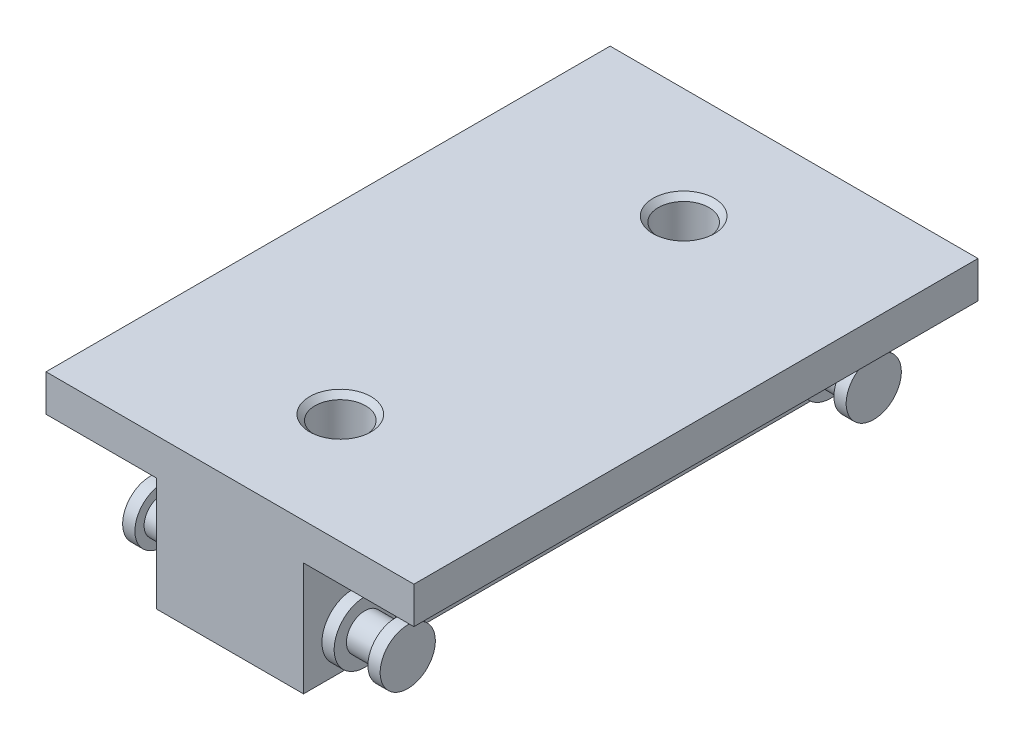
ISO-10303-21;
HEADER;
FILE_DESCRIPTION(('STEP AP214'),'2;1');
FILE_NAME('part.step','',(''),(''),'','','');
FILE_SCHEMA(('AUTOMOTIVE_DESIGN { 1 0 10303 214 1 1 1 1 }'));
ENDSEC;
DATA;
#1=APPLICATION_CONTEXT('core data for automotive mechanical design processes');
#2=APPLICATION_PROTOCOL_DEFINITION('international standard','automotive_design',2000,#1);
#3=PRODUCT_CONTEXT('',#1,'mechanical');
#4=PRODUCT('Part','Part','',(#3));
#5=PRODUCT_RELATED_PRODUCT_CATEGORY('part','',(#4));
#6=PRODUCT_DEFINITION_FORMATION('','',#4);
#7=PRODUCT_DEFINITION_CONTEXT('part definition',#1,'design');
#8=PRODUCT_DEFINITION('design','',#6,#7);
#9=PRODUCT_DEFINITION_SHAPE('','',#8);
#10=(LENGTH_UNIT() NAMED_UNIT(*) SI_UNIT(.MILLI.,.METRE.));
#11=(NAMED_UNIT(*) PLANE_ANGLE_UNIT() SI_UNIT($,.RADIAN.));
#12=(NAMED_UNIT(*) SI_UNIT($,.STERADIAN.) SOLID_ANGLE_UNIT());
#13=UNCERTAINTY_MEASURE_WITH_UNIT(LENGTH_MEASURE(1.E-05),#10,'distance_accuracy_value','');
#14=(GEOMETRIC_REPRESENTATION_CONTEXT(3) GLOBAL_UNCERTAINTY_ASSIGNED_CONTEXT((#13)) GLOBAL_UNIT_ASSIGNED_CONTEXT((#10,
#11,#12)) REPRESENTATION_CONTEXT('',''));
#15=CARTESIAN_POINT('',(0.,0.,0.));
#16=DIRECTION('',(0.,0.,1.));
#17=DIRECTION('',(1.,0.,0.));
#18=AXIS2_PLACEMENT_3D('',#15,#16,#17);
#19=CARTESIAN_POINT('',(-15.,6.25,23.));
#20=DIRECTION('',(-1.,0.,0.));
#21=DIRECTION('',(0.,0.,1.));
#22=AXIS2_PLACEMENT_3D('',#19,#20,#21);
#23=PLANE('',#22);
#24=DIRECTION('',(0.,0.,-1.));
#25=VECTOR('',#24,1.);
#26=CARTESIAN_POINT('',(-15.,3.25,23.));
#27=LINE('',#26,#25);
#28=CARTESIAN_POINT('',(-15.,3.25,23.));
#29=VERTEX_POINT('',#28);
#30=CARTESIAN_POINT('',(-15.,3.25,-23.));
#31=VERTEX_POINT('',#30);
#32=EDGE_CURVE('E161',#29,#31,#27,.T.);
#33=ORIENTED_EDGE('',*,*,#32,.F.);
#34=DIRECTION('',(0.,-1.,0.));
#35=VECTOR('',#34,1.);
#36=CARTESIAN_POINT('',(-15.,6.25,23.));
#37=LINE('',#36,#35);
#38=CARTESIAN_POINT('',(-15.,6.25,23.));
#39=VERTEX_POINT('',#38);
#40=EDGE_CURVE('E11',#39,#29,#37,.T.);
#41=ORIENTED_EDGE('',*,*,#40,.F.);
#42=DIRECTION('',(0.,0.,-1.));
#43=VECTOR('',#42,1.);
#44=CARTESIAN_POINT('',(-15.,6.25,23.));
#45=LINE('',#44,#43);
#46=CARTESIAN_POINT('',(-15.,6.25,-23.));
#47=VERTEX_POINT('',#46);
#48=EDGE_CURVE('E170',#39,#47,#45,.T.);
#49=ORIENTED_EDGE('',*,*,#48,.T.);
#50=DIRECTION('',(0.,-1.,0.));
#51=VECTOR('',#50,1.);
#52=CARTESIAN_POINT('',(-15.,6.25,-23.));
#53=LINE('',#52,#51);
#54=EDGE_CURVE('E46',#47,#31,#53,.T.);
#55=ORIENTED_EDGE('',*,*,#54,.T.);
#56=EDGE_LOOP('',(#33,#41,#49,#55));
#57=FACE_BOUND('',#56,.T.);
#58=ADVANCED_FACE('F43',(#57),#23,.T.);
#59=CARTESIAN_POINT('',(15.,6.25,23.));
#60=DIRECTION('',(0.,0.,1.));
#61=DIRECTION('',(1.,0.,0.));
#62=AXIS2_PLACEMENT_3D('',#59,#60,#61);
#63=PLANE('',#62);
#64=DIRECTION('',(0.,1.,0.));
#65=VECTOR('',#64,1.);
#66=CARTESIAN_POINT('',(6.,-6.,23.));
#67=LINE('',#66,#65);
#68=CARTESIAN_POINT('',(6.,-6.,23.));
#69=VERTEX_POINT('',#68);
#70=CARTESIAN_POINT('',(6.,3.25,23.));
#71=VERTEX_POINT('',#70);
#72=EDGE_CURVE('E60',#69,#71,#67,.T.);
#73=ORIENTED_EDGE('',*,*,#72,.T.);
#74=DIRECTION('',(1.,0.,0.));
#75=VECTOR('',#74,1.);
#76=CARTESIAN_POINT('',(6.,3.25,23.));
#77=LINE('',#76,#75);
#78=CARTESIAN_POINT('',(15.,3.25,23.));
#79=VERTEX_POINT('',#78);
#80=EDGE_CURVE('E118',#71,#79,#77,.T.);
#81=ORIENTED_EDGE('',*,*,#80,.T.);
#82=DIRECTION('',(0.,-1.,0.));
#83=VECTOR('',#82,1.);
#84=CARTESIAN_POINT('',(15.,6.25,23.));
#85=LINE('',#84,#83);
#86=CARTESIAN_POINT('',(15.,6.25,23.));
#87=VERTEX_POINT('',#86);
#88=EDGE_CURVE('E52',#87,#79,#85,.T.);
#89=ORIENTED_EDGE('',*,*,#88,.F.);
#90=DIRECTION('',(-1.,0.,0.));
#91=VECTOR('',#90,1.);
#92=CARTESIAN_POINT('',(15.,6.25,23.));
#93=LINE('',#92,#91);
#94=EDGE_CURVE('E182',#87,#39,#93,.T.);
#95=ORIENTED_EDGE('',*,*,#94,.T.);
#96=ORIENTED_EDGE('',*,*,#40,.T.);
#97=DIRECTION('',(1.,0.,0.));
#98=VECTOR('',#97,1.);
#99=CARTESIAN_POINT('',(-15.,3.25,23.));
#100=LINE('',#99,#98);
#101=CARTESIAN_POINT('',(-6.,3.25,23.));
#102=VERTEX_POINT('',#101);
#103=EDGE_CURVE('E148',#29,#102,#100,.T.);
#104=ORIENTED_EDGE('',*,*,#103,.T.);
#105=DIRECTION('',(0.,-1.,0.));
#106=VECTOR('',#105,1.);
#107=CARTESIAN_POINT('',(-6.,3.25,23.));
#108=LINE('',#107,#106);
#109=CARTESIAN_POINT('',(-6.,-6.,23.));
#110=VERTEX_POINT('',#109);
#111=EDGE_CURVE('E152',#102,#110,#108,.T.);
#112=ORIENTED_EDGE('',*,*,#111,.T.);
#113=DIRECTION('',(-1.,0.,0.));
#114=VECTOR('',#113,1.);
#115=CARTESIAN_POINT('',(15.,-6.,23.));
#116=LINE('',#115,#114);
#117=EDGE_CURVE('E130',#69,#110,#116,.T.);
#118=ORIENTED_EDGE('',*,*,#117,.F.);
#119=EDGE_LOOP('',(#73,#81,#89,#95,#96,#104,#112,#118));
#120=FACE_BOUND('',#119,.T.);
#121=ADVANCED_FACE('F128',(#120),#63,.T.);
#122=CARTESIAN_POINT('',(15.,6.25,-23.));
#123=DIRECTION('',(1.,0.,0.));
#124=DIRECTION('',(0.,0.,-1.));
#125=AXIS2_PLACEMENT_3D('',#122,#123,#124);
#126=PLANE('',#125);
#127=DIRECTION('',(0.,0.,-1.));
#128=VECTOR('',#127,1.);
#129=CARTESIAN_POINT('',(15.,3.25,23.));
#130=LINE('',#129,#128);
#131=CARTESIAN_POINT('',(15.,3.25,-23.));
#132=VERTEX_POINT('',#131);
#133=EDGE_CURVE('E117',#79,#132,#130,.T.);
#134=ORIENTED_EDGE('',*,*,#133,.T.);
#135=DIRECTION('',(0.,-1.,0.));
#136=VECTOR('',#135,1.);
#137=CARTESIAN_POINT('',(15.,6.25,-23.));
#138=LINE('',#137,#136);
#139=CARTESIAN_POINT('',(15.,6.25,-23.));
#140=VERTEX_POINT('',#139);
#141=EDGE_CURVE('E192',#140,#132,#138,.T.);
#142=ORIENTED_EDGE('',*,*,#141,.F.);
#143=DIRECTION('',(0.,0.,1.));
#144=VECTOR('',#143,1.);
#145=CARTESIAN_POINT('',(15.,6.25,-23.));
#146=LINE('',#145,#144);
#147=EDGE_CURVE('E178',#140,#87,#146,.T.);
#148=ORIENTED_EDGE('',*,*,#147,.T.);
#149=ORIENTED_EDGE('',*,*,#88,.T.);
#150=EDGE_LOOP('',(#134,#142,#148,#149));
#151=FACE_BOUND('',#150,.T.);
#152=ADVANCED_FACE('F209',(#151),#126,.T.);
#153=CARTESIAN_POINT('',(-15.,6.25,-23.));
#154=DIRECTION('',(0.,0.,-1.));
#155=DIRECTION('',(-1.,0.,0.));
#156=AXIS2_PLACEMENT_3D('',#153,#154,#155);
#157=PLANE('',#156);
#158=DIRECTION('',(0.,1.,0.));
#159=VECTOR('',#158,1.);
#160=CARTESIAN_POINT('',(6.,-6.,-23.));
#161=LINE('',#160,#159);
#162=CARTESIAN_POINT('',(6.,-6.,-23.));
#163=VERTEX_POINT('',#162);
#164=CARTESIAN_POINT('',(6.,3.25,-23.));
#165=VERTEX_POINT('',#164);
#166=EDGE_CURVE('E113',#163,#165,#161,.T.);
#167=ORIENTED_EDGE('',*,*,#166,.F.);
#168=DIRECTION('',(1.,0.,0.));
#169=VECTOR('',#168,1.);
#170=CARTESIAN_POINT('',(-15.,-6.,-23.));
#171=LINE('',#170,#169);
#172=CARTESIAN_POINT('',(-6.,-6.,-23.));
#173=VERTEX_POINT('',#172);
#174=EDGE_CURVE('E164',#173,#163,#171,.T.);
#175=ORIENTED_EDGE('',*,*,#174,.F.);
#176=DIRECTION('',(0.,-1.,0.));
#177=VECTOR('',#176,1.);
#178=CARTESIAN_POINT('',(-6.,3.25,-23.));
#179=LINE('',#178,#177);
#180=CARTESIAN_POINT('',(-6.,3.25,-23.));
#181=VERTEX_POINT('',#180);
#182=EDGE_CURVE('E68',#181,#173,#179,.T.);
#183=ORIENTED_EDGE('',*,*,#182,.F.);
#184=DIRECTION('',(1.,0.,0.));
#185=VECTOR('',#184,1.);
#186=CARTESIAN_POINT('',(-15.,3.25,-23.));
#187=LINE('',#186,#185);
#188=EDGE_CURVE('E145',#31,#181,#187,.T.);
#189=ORIENTED_EDGE('',*,*,#188,.F.);
#190=ORIENTED_EDGE('',*,*,#54,.F.);
#191=DIRECTION('',(1.,0.,0.));
#192=VECTOR('',#191,1.);
#193=CARTESIAN_POINT('',(-15.,6.25,-23.));
#194=LINE('',#193,#192);
#195=EDGE_CURVE('E174',#47,#140,#194,.T.);
#196=ORIENTED_EDGE('',*,*,#195,.T.);
#197=ORIENTED_EDGE('',*,*,#141,.T.);
#198=DIRECTION('',(1.,0.,0.));
#199=VECTOR('',#198,1.);
#200=CARTESIAN_POINT('',(6.,3.25,-23.));
#201=LINE('',#200,#199);
#202=EDGE_CURVE('E132',#165,#132,#201,.T.);
#203=ORIENTED_EDGE('',*,*,#202,.F.);
#204=EDGE_LOOP('',(#167,#175,#183,#189,#190,#196,#197,#203));
#205=FACE_BOUND('',#204,.T.);
#206=ADVANCED_FACE('F203',(#205),#157,.T.);
#207=CARTESIAN_POINT('',(0.,6.25,0.));
#208=DIRECTION('',(0.,-1.,0.));
#209=DIRECTION('',(0.,0.,-1.));
#210=AXIS2_PLACEMENT_3D('',#207,#208,#209);
#211=PLANE('',#210);
#212=CARTESIAN_POINT('',(0.,6.25,-14.));
#213=DIRECTION('',(0.,-1.,0.));
#214=DIRECTION('',(0.,0.,-1.));
#215=AXIS2_PLACEMENT_3D('',#212,#213,#214);
#216=CIRCLE('',#215,2.5);
#217=CARTESIAN_POINT('',(0.,6.25,-16.5));
#218=VERTEX_POINT('',#217);
#219=EDGE_CURVE('E819',#218,#218,#216,.T.);
#220=ORIENTED_EDGE('',*,*,#219,.T.);
#221=EDGE_LOOP('',(#220));
#222=FACE_BOUND('',#221,.T.);
#223=CARTESIAN_POINT('',(0.,6.25,14.));
#224=DIRECTION('',(0.,-1.,0.));
#225=DIRECTION('',(0.,0.,-1.));
#226=AXIS2_PLACEMENT_3D('',#223,#224,#225);
#227=CIRCLE('',#226,2.5);
#228=CARTESIAN_POINT('',(0.,6.25,11.5));
#229=VERTEX_POINT('',#228);
#230=EDGE_CURVE('E803',#229,#229,#227,.T.);
#231=ORIENTED_EDGE('',*,*,#230,.T.);
#232=EDGE_LOOP('',(#231));
#233=FACE_BOUND('',#232,.T.);
#234=ORIENTED_EDGE('',*,*,#48,.F.);
#235=ORIENTED_EDGE('',*,*,#94,.F.);
#236=ORIENTED_EDGE('',*,*,#147,.F.);
#237=ORIENTED_EDGE('',*,*,#195,.F.);
#238=EDGE_LOOP('',(#234,#235,#236,#237));
#239=FACE_BOUND('',#238,.T.);
#240=ADVANCED_FACE('F206',(#222,#233,#239),#211,.F.);
#241=CARTESIAN_POINT('',(0.,-6.,0.));
#242=DIRECTION('',(0.,-1.,0.));
#243=DIRECTION('',(0.,0.,-1.));
#244=AXIS2_PLACEMENT_3D('',#241,#242,#243);
#245=PLANE('',#244);
#246=CARTESIAN_POINT('',(0.,-6.,-14.));
#247=DIRECTION('',(0.,-1.,0.));
#248=DIRECTION('',(0.,0.,-1.));
#249=AXIS2_PLACEMENT_3D('',#246,#247,#248);
#250=CIRCLE('',#249,2.5);
#251=CARTESIAN_POINT('',(0.,-6.,-16.5));
#252=VERTEX_POINT('',#251);
#253=EDGE_CURVE('E815',#252,#252,#250,.T.);
#254=ORIENTED_EDGE('',*,*,#253,.F.);
#255=EDGE_LOOP('',(#254));
#256=FACE_BOUND('',#255,.T.);
#257=CARTESIAN_POINT('',(0.,-6.,14.));
#258=DIRECTION('',(0.,-1.,0.));
#259=DIRECTION('',(0.,0.,-1.));
#260=AXIS2_PLACEMENT_3D('',#257,#258,#259);
#261=CIRCLE('',#260,2.5);
#262=CARTESIAN_POINT('',(0.,-6.,11.5));
#263=VERTEX_POINT('',#262);
#264=EDGE_CURVE('E799',#263,#263,#261,.T.);
#265=ORIENTED_EDGE('',*,*,#264,.F.);
#266=EDGE_LOOP('',(#265));
#267=FACE_BOUND('',#266,.T.);
#268=DIRECTION('',(0.,0.,-1.));
#269=VECTOR('',#268,1.);
#270=CARTESIAN_POINT('',(6.,-6.,23.));
#271=LINE('',#270,#269);
#272=EDGE_CURVE('E142',#69,#163,#271,.T.);
#273=ORIENTED_EDGE('',*,*,#272,.F.);
#274=ORIENTED_EDGE('',*,*,#117,.T.);
#275=DIRECTION('',(0.,0.,-1.));
#276=VECTOR('',#275,1.);
#277=CARTESIAN_POINT('',(-6.,-6.,23.));
#278=LINE('',#277,#276);
#279=EDGE_CURVE('E165',#110,#173,#278,.T.);
#280=ORIENTED_EDGE('',*,*,#279,.T.);
#281=ORIENTED_EDGE('',*,*,#174,.T.);
#282=EDGE_LOOP('',(#273,#274,#280,#281));
#283=FACE_BOUND('',#282,.T.);
#284=ADVANCED_FACE('F216',(#256,#267,#283),#245,.T.);
#285=CARTESIAN_POINT('',(-15.,3.25,23.));
#286=DIRECTION('',(0.,1.,0.));
#287=DIRECTION('',(0.,0.,1.));
#288=AXIS2_PLACEMENT_3D('',#285,#286,#287);
#289=PLANE('',#288);
#290=ORIENTED_EDGE('',*,*,#188,.T.);
#291=DIRECTION('',(0.,0.,-1.));
#292=VECTOR('',#291,1.);
#293=CARTESIAN_POINT('',(-6.,3.25,23.));
#294=LINE('',#293,#292);
#295=EDGE_CURVE('E155',#102,#181,#294,.T.);
#296=ORIENTED_EDGE('',*,*,#295,.F.);
#297=ORIENTED_EDGE('',*,*,#103,.F.);
#298=ORIENTED_EDGE('',*,*,#32,.T.);
#299=EDGE_LOOP('',(#290,#296,#297,#298));
#300=FACE_BOUND('',#299,.T.);
#301=ADVANCED_FACE('F212',(#300),#289,.F.);
#302=CARTESIAN_POINT('',(-6.,3.25,23.));
#303=DIRECTION('',(1.,0.,0.));
#304=DIRECTION('',(0.,0.,-1.));
#305=AXIS2_PLACEMENT_3D('',#302,#303,#304);
#306=PLANE('',#305);
#307=CARTESIAN_POINT('',(-6.,-3.125,-19.));
#308=DIRECTION('',(1.,0.,0.));
#309=DIRECTION('',(0.,1.,0.));
#310=AXIS2_PLACEMENT_3D('',#307,#308,#309);
#311=CIRCLE('',#310,2.5);
#312=CARTESIAN_POINT('',(-6.,-0.625,-19.));
#313=VERTEX_POINT('',#312);
#314=EDGE_CURVE('E684',#313,#313,#311,.T.);
#315=ORIENTED_EDGE('',*,*,#314,.T.);
#316=EDGE_LOOP('',(#315));
#317=FACE_BOUND('',#316,.T.);
#318=CARTESIAN_POINT('',(-6.,-3.125,19.));
#319=DIRECTION('',(1.,0.,0.));
#320=DIRECTION('',(0.,1.,0.));
#321=AXIS2_PLACEMENT_3D('',#318,#319,#320);
#322=CIRCLE('',#321,2.5);
#323=CARTESIAN_POINT('',(-6.,-0.625,19.));
#324=VERTEX_POINT('',#323);
#325=EDGE_CURVE('E687',#324,#324,#322,.T.);
#326=ORIENTED_EDGE('',*,*,#325,.T.);
#327=EDGE_LOOP('',(#326));
#328=FACE_BOUND('',#327,.T.);
#329=ORIENTED_EDGE('',*,*,#182,.T.);
#330=ORIENTED_EDGE('',*,*,#279,.F.);
#331=ORIENTED_EDGE('',*,*,#111,.F.);
#332=ORIENTED_EDGE('',*,*,#295,.T.);
#333=EDGE_LOOP('',(#329,#330,#331,#332));
#334=FACE_BOUND('',#333,.T.);
#335=ADVANCED_FACE('F213',(#317,#328,#334),#306,.F.);
#336=CARTESIAN_POINT('',(6.,-6.,23.));
#337=DIRECTION('',(-1.,0.,0.));
#338=DIRECTION('',(0.,0.,1.));
#339=AXIS2_PLACEMENT_3D('',#336,#337,#338);
#340=PLANE('',#339);
#341=CARTESIAN_POINT('',(6.,-3.125,-19.));
#342=DIRECTION('',(1.,0.,0.));
#343=DIRECTION('',(0.,0.,-1.));
#344=AXIS2_PLACEMENT_3D('',#341,#342,#343);
#345=CIRCLE('',#344,2.5);
#346=CARTESIAN_POINT('',(6.,-3.125,-21.5));
#347=VERTEX_POINT('',#346);
#348=EDGE_CURVE('E745',#347,#347,#345,.T.);
#349=ORIENTED_EDGE('',*,*,#348,.F.);
#350=EDGE_LOOP('',(#349));
#351=FACE_BOUND('',#350,.T.);
#352=CARTESIAN_POINT('',(6.,-3.125,19.));
#353=DIRECTION('',(1.,0.,0.));
#354=DIRECTION('',(0.,0.,-1.));
#355=AXIS2_PLACEMENT_3D('',#352,#353,#354);
#356=CIRCLE('',#355,2.5);
#357=CARTESIAN_POINT('',(6.,-3.125,16.5));
#358=VERTEX_POINT('',#357);
#359=EDGE_CURVE('E137',#358,#358,#356,.T.);
#360=ORIENTED_EDGE('',*,*,#359,.F.);
#361=EDGE_LOOP('',(#360));
#362=FACE_BOUND('',#361,.T.);
#363=ORIENTED_EDGE('',*,*,#166,.T.);
#364=DIRECTION('',(0.,0.,-1.));
#365=VECTOR('',#364,1.);
#366=CARTESIAN_POINT('',(6.,3.25,23.));
#367=LINE('',#366,#365);
#368=EDGE_CURVE('E109',#71,#165,#367,.T.);
#369=ORIENTED_EDGE('',*,*,#368,.F.);
#370=ORIENTED_EDGE('',*,*,#72,.F.);
#371=ORIENTED_EDGE('',*,*,#272,.T.);
#372=EDGE_LOOP('',(#363,#369,#370,#371));
#373=FACE_BOUND('',#372,.T.);
#374=ADVANCED_FACE('F111',(#351,#362,#373),#340,.F.);
#375=CARTESIAN_POINT('',(6.,3.25,23.));
#376=DIRECTION('',(0.,1.,0.));
#377=DIRECTION('',(0.,0.,1.));
#378=AXIS2_PLACEMENT_3D('',#375,#376,#377);
#379=PLANE('',#378);
#380=ORIENTED_EDGE('',*,*,#202,.T.);
#381=ORIENTED_EDGE('',*,*,#133,.F.);
#382=ORIENTED_EDGE('',*,*,#80,.F.);
#383=ORIENTED_EDGE('',*,*,#368,.T.);
#384=EDGE_LOOP('',(#380,#381,#382,#383));
#385=FACE_BOUND('',#384,.T.);
#386=ADVANCED_FACE('F121',(#385),#379,.F.);
#387=CARTESIAN_POINT('',(6.,-3.125,19.));
#388=DIRECTION('',(1.,0.,0.));
#389=DIRECTION('',(0.,0.,-1.));
#390=AXIS2_PLACEMENT_3D('',#387,#388,#389);
#391=CYLINDRICAL_SURFACE('',#390,2.5);
#392=ORIENTED_EDGE('',*,*,#359,.T.);
#393=EDGE_LOOP('',(#392));
#394=FACE_BOUND('',#393,.T.);
#395=CARTESIAN_POINT('',(7.,-3.125,19.));
#396=DIRECTION('',(1.,0.,0.));
#397=DIRECTION('',(0.,0.,-1.));
#398=AXIS2_PLACEMENT_3D('',#395,#396,#397);
#399=CIRCLE('',#398,2.5);
#400=CARTESIAN_POINT('',(7.,-3.125,16.5));
#401=VERTEX_POINT('',#400);
#402=EDGE_CURVE('E696',#401,#401,#399,.T.);
#403=ORIENTED_EDGE('',*,*,#402,.F.);
#404=EDGE_LOOP('',(#403));
#405=FACE_BOUND('',#404,.T.);
#406=ADVANCED_FACE('F558',(#394,#405),#391,.T.);
#407=CARTESIAN_POINT('',(10.5,-3.125,19.));
#408=DIRECTION('',(1.,0.,0.));
#409=DIRECTION('',(0.,0.,-1.));
#410=AXIS2_PLACEMENT_3D('',#407,#408,#409);
#411=PLANE('',#410);
#412=CARTESIAN_POINT('',(10.5,-3.125,19.));
#413=DIRECTION('',(1.,0.,0.));
#414=DIRECTION('',(0.,0.,-1.));
#415=AXIS2_PLACEMENT_3D('',#412,#413,#414);
#416=CIRCLE('',#415,2.25);
#417=CARTESIAN_POINT('',(10.5,-3.125,16.75));
#418=VERTEX_POINT('',#417);
#419=EDGE_CURVE('E717',#418,#418,#416,.T.);
#420=ORIENTED_EDGE('',*,*,#419,.T.);
#421=EDGE_LOOP('',(#420));
#422=FACE_BOUND('',#421,.T.);
#423=ADVANCED_FACE('F548',(#422),#411,.T.);
#424=CARTESIAN_POINT('',(6.,-3.125,19.));
#425=DIRECTION('',(1.,0.,0.));
#426=DIRECTION('',(0.,0.,-1.));
#427=AXIS2_PLACEMENT_3D('',#424,#425,#426);
#428=CYLINDRICAL_SURFACE('',#427,2.25);
#429=CARTESIAN_POINT('',(9.5,-3.125,19.));
#430=DIRECTION('',(1.,0.,0.));
#431=DIRECTION('',(0.,0.,-1.));
#432=AXIS2_PLACEMENT_3D('',#429,#430,#431);
#433=CIRCLE('',#432,2.25);
#434=CARTESIAN_POINT('',(9.5,-3.125,16.75));
#435=VERTEX_POINT('',#434);
#436=EDGE_CURVE('E714',#435,#435,#433,.T.);
#437=ORIENTED_EDGE('',*,*,#436,.T.);
#438=EDGE_LOOP('',(#437));
#439=FACE_BOUND('',#438,.T.);
#440=ORIENTED_EDGE('',*,*,#419,.F.);
#441=EDGE_LOOP('',(#440));
#442=FACE_BOUND('',#441,.T.);
#443=ADVANCED_FACE('F538',(#439,#442),#428,.T.);
#444=CARTESIAN_POINT('',(9.5,-0.875,19.));
#445=DIRECTION('',(-1.,0.,0.));
#446=DIRECTION('',(0.,0.,1.));
#447=AXIS2_PLACEMENT_3D('',#444,#445,#446);
#448=PLANE('',#447);
#449=CARTESIAN_POINT('',(9.5,-3.125,19.));
#450=DIRECTION('',(1.,0.,0.));
#451=DIRECTION('',(0.,0.,-1.));
#452=AXIS2_PLACEMENT_3D('',#449,#450,#451);
#453=CIRCLE('',#452,1.5);
#454=CARTESIAN_POINT('',(9.5,-3.125,17.5));
#455=VERTEX_POINT('',#454);
#456=EDGE_CURVE('E710',#455,#455,#453,.T.);
#457=ORIENTED_EDGE('',*,*,#456,.T.);
#458=EDGE_LOOP('',(#457));
#459=FACE_BOUND('',#458,.T.);
#460=ORIENTED_EDGE('',*,*,#436,.F.);
#461=EDGE_LOOP('',(#460));
#462=FACE_BOUND('',#461,.T.);
#463=ADVANCED_FACE('F528',(#459,#462),#448,.T.);
#464=CARTESIAN_POINT('',(6.,-3.125,19.));
#465=DIRECTION('',(1.,0.,0.));
#466=DIRECTION('',(0.,0.,-1.));
#467=AXIS2_PLACEMENT_3D('',#464,#465,#466);
#468=CYLINDRICAL_SURFACE('',#467,1.5);
#469=CARTESIAN_POINT('',(7.,-3.125,19.));
#470=DIRECTION('',(1.,0.,0.));
#471=DIRECTION('',(0.,0.,-1.));
#472=AXIS2_PLACEMENT_3D('',#469,#470,#471);
#473=CIRCLE('',#472,1.5);
#474=CARTESIAN_POINT('',(7.,-3.125,17.5));
#475=VERTEX_POINT('',#474);
#476=EDGE_CURVE('E706',#475,#475,#473,.T.);
#477=ORIENTED_EDGE('',*,*,#476,.T.);
#478=EDGE_LOOP('',(#477));
#479=FACE_BOUND('',#478,.T.);
#480=ORIENTED_EDGE('',*,*,#456,.F.);
#481=EDGE_LOOP('',(#480));
#482=FACE_BOUND('',#481,.T.);
#483=ADVANCED_FACE('F518',(#479,#482),#468,.T.);
#484=CARTESIAN_POINT('',(7.,-1.625,19.));
#485=DIRECTION('',(1.,0.,0.));
#486=DIRECTION('',(0.,0.,-1.));
#487=AXIS2_PLACEMENT_3D('',#484,#485,#486);
#488=PLANE('',#487);
#489=ORIENTED_EDGE('',*,*,#402,.T.);
#490=EDGE_LOOP('',(#489));
#491=FACE_BOUND('',#490,.T.);
#492=ORIENTED_EDGE('',*,*,#476,.F.);
#493=EDGE_LOOP('',(#492));
#494=FACE_BOUND('',#493,.T.);
#495=ADVANCED_FACE('F508',(#491,#494),#488,.T.);
#496=CARTESIAN_POINT('',(-10.5,-3.125,19.));
#497=DIRECTION('',(1.,0.,0.));
#498=DIRECTION('',(0.,1.,0.));
#499=AXIS2_PLACEMENT_3D('',#496,#497,#498);
#500=CYLINDRICAL_SURFACE('',#499,2.25);
#501=CARTESIAN_POINT('',(-10.5,-3.125,19.));
#502=DIRECTION('',(1.,0.,0.));
#503=DIRECTION('',(0.,1.,0.));
#504=AXIS2_PLACEMENT_3D('',#501,#502,#503);
#505=CIRCLE('',#504,2.25);
#506=CARTESIAN_POINT('',(-10.5,-0.875,19.));
#507=VERTEX_POINT('',#506);
#508=EDGE_CURVE('E690',#507,#507,#505,.T.);
#509=ORIENTED_EDGE('',*,*,#508,.T.);
#510=EDGE_LOOP('',(#509));
#511=FACE_BOUND('',#510,.T.);
#512=CARTESIAN_POINT('',(-9.5,-3.125,19.));
#513=DIRECTION('',(1.,0.,0.));
#514=DIRECTION('',(0.,1.,0.));
#515=AXIS2_PLACEMENT_3D('',#512,#513,#514);
#516=CIRCLE('',#515,2.25);
#517=CARTESIAN_POINT('',(-9.5,-0.875,19.));
#518=VERTEX_POINT('',#517);
#519=EDGE_CURVE('E741',#518,#518,#516,.T.);
#520=ORIENTED_EDGE('',*,*,#519,.F.);
#521=EDGE_LOOP('',(#520));
#522=FACE_BOUND('',#521,.T.);
#523=ADVANCED_FACE('F498',(#511,#522),#500,.T.);
#524=CARTESIAN_POINT('',(-10.5,-0.875,19.));
#525=DIRECTION('',(-1.,0.,0.));
#526=DIRECTION('',(0.,-1.,0.));
#527=AXIS2_PLACEMENT_3D('',#524,#525,#526);
#528=PLANE('',#527);
#529=ORIENTED_EDGE('',*,*,#508,.F.);
#530=EDGE_LOOP('',(#529));
#531=FACE_BOUND('',#530,.T.);
#532=ADVANCED_FACE('F488',(#531),#528,.T.);
#533=CARTESIAN_POINT('',(-10.5,-3.125,19.));
#534=DIRECTION('',(1.,0.,0.));
#535=DIRECTION('',(0.,1.,0.));
#536=AXIS2_PLACEMENT_3D('',#533,#534,#535);
#537=CYLINDRICAL_SURFACE('',#536,2.5);
#538=CARTESIAN_POINT('',(-7.,-3.125,19.));
#539=DIRECTION('',(1.,0.,0.));
#540=DIRECTION('',(0.,1.,0.));
#541=AXIS2_PLACEMENT_3D('',#538,#539,#540);
#542=CIRCLE('',#541,2.5);
#543=CARTESIAN_POINT('',(-7.,-0.625,19.));
#544=VERTEX_POINT('',#543);
#545=EDGE_CURVE('E691',#544,#544,#542,.T.);
#546=ORIENTED_EDGE('',*,*,#545,.T.);
#547=EDGE_LOOP('',(#546));
#548=FACE_BOUND('',#547,.T.);
#549=ORIENTED_EDGE('',*,*,#325,.F.);
#550=EDGE_LOOP('',(#549));
#551=FACE_BOUND('',#550,.T.);
#552=ADVANCED_FACE('F478',(#548,#551),#537,.T.);
#553=CARTESIAN_POINT('',(-7.,-0.625,19.));
#554=DIRECTION('',(-1.,0.,0.));
#555=DIRECTION('',(0.,-1.,0.));
#556=AXIS2_PLACEMENT_3D('',#553,#554,#555);
#557=PLANE('',#556);
#558=CARTESIAN_POINT('',(-7.,-3.125,19.));
#559=DIRECTION('',(1.,0.,0.));
#560=DIRECTION('',(0.,1.,0.));
#561=AXIS2_PLACEMENT_3D('',#558,#559,#560);
#562=CIRCLE('',#561,1.5);
#563=CARTESIAN_POINT('',(-7.,-1.625,19.));
#564=VERTEX_POINT('',#563);
#565=EDGE_CURVE('E699',#564,#564,#562,.T.);
#566=ORIENTED_EDGE('',*,*,#565,.T.);
#567=EDGE_LOOP('',(#566));
#568=FACE_BOUND('',#567,.T.);
#569=ORIENTED_EDGE('',*,*,#545,.F.);
#570=EDGE_LOOP('',(#569));
#571=FACE_BOUND('',#570,.T.);
#572=ADVANCED_FACE('F468',(#568,#571),#557,.T.);
#573=CARTESIAN_POINT('',(-10.5,-3.125,19.));
#574=DIRECTION('',(1.,0.,0.));
#575=DIRECTION('',(0.,1.,0.));
#576=AXIS2_PLACEMENT_3D('',#573,#574,#575);
#577=CYLINDRICAL_SURFACE('',#576,1.5);
#578=CARTESIAN_POINT('',(-9.5,-3.125,19.));
#579=DIRECTION('',(1.,0.,0.));
#580=DIRECTION('',(0.,1.,0.));
#581=AXIS2_PLACEMENT_3D('',#578,#579,#580);
#582=CIRCLE('',#581,1.5);
#583=CARTESIAN_POINT('',(-9.5,-1.625,19.));
#584=VERTEX_POINT('',#583);
#585=EDGE_CURVE('E737',#584,#584,#582,.T.);
#586=ORIENTED_EDGE('',*,*,#585,.T.);
#587=EDGE_LOOP('',(#586));
#588=FACE_BOUND('',#587,.T.);
#589=ORIENTED_EDGE('',*,*,#565,.F.);
#590=EDGE_LOOP('',(#589));
#591=FACE_BOUND('',#590,.T.);
#592=ADVANCED_FACE('F458',(#588,#591),#577,.T.);
#593=CARTESIAN_POINT('',(-9.5,-1.625,19.));
#594=DIRECTION('',(1.,0.,0.));
#595=DIRECTION('',(0.,1.,0.));
#596=AXIS2_PLACEMENT_3D('',#593,#594,#595);
#597=PLANE('',#596);
#598=ORIENTED_EDGE('',*,*,#519,.T.);
#599=EDGE_LOOP('',(#598));
#600=FACE_BOUND('',#599,.T.);
#601=ORIENTED_EDGE('',*,*,#585,.F.);
#602=EDGE_LOOP('',(#601));
#603=FACE_BOUND('',#602,.T.);
#604=ADVANCED_FACE('F448',(#600,#603),#597,.T.);
#605=CARTESIAN_POINT('',(6.,-3.125,-19.));
#606=DIRECTION('',(1.,0.,0.));
#607=DIRECTION('',(0.,0.,-1.));
#608=AXIS2_PLACEMENT_3D('',#605,#606,#607);
#609=CYLINDRICAL_SURFACE('',#608,2.5);
#610=ORIENTED_EDGE('',*,*,#348,.T.);
#611=EDGE_LOOP('',(#610));
#612=FACE_BOUND('',#611,.T.);
#613=CARTESIAN_POINT('',(7.,-3.125,-19.));
#614=DIRECTION('',(1.,0.,0.));
#615=DIRECTION('',(0.,0.,-1.));
#616=AXIS2_PLACEMENT_3D('',#613,#614,#615);
#617=CIRCLE('',#616,2.5);
#618=CARTESIAN_POINT('',(7.,-3.125,-21.5));
#619=VERTEX_POINT('',#618);
#620=EDGE_CURVE('E765',#619,#619,#617,.T.);
#621=ORIENTED_EDGE('',*,*,#620,.F.);
#622=EDGE_LOOP('',(#621));
#623=FACE_BOUND('',#622,.T.);
#624=ADVANCED_FACE('F438',(#612,#623),#609,.T.);
#625=CARTESIAN_POINT('',(10.5,-3.125,-19.));
#626=DIRECTION('',(1.,0.,0.));
#627=DIRECTION('',(0.,0.,-1.));
#628=AXIS2_PLACEMENT_3D('',#625,#626,#627);
#629=PLANE('',#628);
#630=CARTESIAN_POINT('',(10.5,-3.125,-19.));
#631=DIRECTION('',(1.,0.,0.));
#632=DIRECTION('',(0.,0.,-1.));
#633=AXIS2_PLACEMENT_3D('',#630,#631,#632);
#634=CIRCLE('',#633,2.25);
#635=CARTESIAN_POINT('',(10.5,-3.125,-21.25));
#636=VERTEX_POINT('',#635);
#637=EDGE_CURVE('E749',#636,#636,#634,.T.);
#638=ORIENTED_EDGE('',*,*,#637,.T.);
#639=EDGE_LOOP('',(#638));
#640=FACE_BOUND('',#639,.T.);
#641=ADVANCED_FACE('F428',(#640),#629,.T.);
#642=CARTESIAN_POINT('',(6.,-3.125,-19.));
#643=DIRECTION('',(1.,0.,0.));
#644=DIRECTION('',(0.,0.,-1.));
#645=AXIS2_PLACEMENT_3D('',#642,#643,#644);
#646=CYLINDRICAL_SURFACE('',#645,2.25);
#647=CARTESIAN_POINT('',(9.5,-3.125,-19.));
#648=DIRECTION('',(1.,0.,0.));
#649=DIRECTION('',(0.,0.,-1.));
#650=AXIS2_PLACEMENT_3D('',#647,#648,#649);
#651=CIRCLE('',#650,2.25);
#652=CARTESIAN_POINT('',(9.5,-3.125,-21.25));
#653=VERTEX_POINT('',#652);
#654=EDGE_CURVE('E753',#653,#653,#651,.T.);
#655=ORIENTED_EDGE('',*,*,#654,.T.);
#656=EDGE_LOOP('',(#655));
#657=FACE_BOUND('',#656,.T.);
#658=ORIENTED_EDGE('',*,*,#637,.F.);
#659=EDGE_LOOP('',(#658));
#660=FACE_BOUND('',#659,.T.);
#661=ADVANCED_FACE('F418',(#657,#660),#646,.T.);
#662=CARTESIAN_POINT('',(9.5,-0.875,-19.));
#663=DIRECTION('',(-1.,0.,0.));
#664=DIRECTION('',(0.,0.,1.));
#665=AXIS2_PLACEMENT_3D('',#662,#663,#664);
#666=PLANE('',#665);
#667=CARTESIAN_POINT('',(9.5,-3.125,-19.));
#668=DIRECTION('',(1.,0.,0.));
#669=DIRECTION('',(0.,0.,-1.));
#670=AXIS2_PLACEMENT_3D('',#667,#668,#669);
#671=CIRCLE('',#670,1.5);
#672=CARTESIAN_POINT('',(9.5,-3.125,-20.5));
#673=VERTEX_POINT('',#672);
#674=EDGE_CURVE('E757',#673,#673,#671,.T.);
#675=ORIENTED_EDGE('',*,*,#674,.T.);
#676=EDGE_LOOP('',(#675));
#677=FACE_BOUND('',#676,.T.);
#678=ORIENTED_EDGE('',*,*,#654,.F.);
#679=EDGE_LOOP('',(#678));
#680=FACE_BOUND('',#679,.T.);
#681=ADVANCED_FACE('F408',(#677,#680),#666,.T.);
#682=CARTESIAN_POINT('',(6.,-3.125,-19.));
#683=DIRECTION('',(1.,0.,0.));
#684=DIRECTION('',(0.,0.,-1.));
#685=AXIS2_PLACEMENT_3D('',#682,#683,#684);
#686=CYLINDRICAL_SURFACE('',#685,1.5);
#687=CARTESIAN_POINT('',(7.,-3.125,-19.));
#688=DIRECTION('',(1.,0.,0.));
#689=DIRECTION('',(0.,0.,-1.));
#690=AXIS2_PLACEMENT_3D('',#687,#688,#689);
#691=CIRCLE('',#690,1.5);
#692=CARTESIAN_POINT('',(7.,-3.125,-20.5));
#693=VERTEX_POINT('',#692);
#694=EDGE_CURVE('E761',#693,#693,#691,.T.);
#695=ORIENTED_EDGE('',*,*,#694,.T.);
#696=EDGE_LOOP('',(#695));
#697=FACE_BOUND('',#696,.T.);
#698=ORIENTED_EDGE('',*,*,#674,.F.);
#699=EDGE_LOOP('',(#698));
#700=FACE_BOUND('',#699,.T.);
#701=ADVANCED_FACE('F398',(#697,#700),#686,.T.);
#702=CARTESIAN_POINT('',(7.,-1.625,-19.));
#703=DIRECTION('',(1.,0.,0.));
#704=DIRECTION('',(0.,0.,-1.));
#705=AXIS2_PLACEMENT_3D('',#702,#703,#704);
#706=PLANE('',#705);
#707=ORIENTED_EDGE('',*,*,#620,.T.);
#708=EDGE_LOOP('',(#707));
#709=FACE_BOUND('',#708,.T.);
#710=ORIENTED_EDGE('',*,*,#694,.F.);
#711=EDGE_LOOP('',(#710));
#712=FACE_BOUND('',#711,.T.);
#713=ADVANCED_FACE('F388',(#709,#712),#706,.T.);
#714=CARTESIAN_POINT('',(-10.5,-3.125,-19.));
#715=DIRECTION('',(1.,0.,0.));
#716=DIRECTION('',(0.,1.,0.));
#717=AXIS2_PLACEMENT_3D('',#714,#715,#716);
#718=CYLINDRICAL_SURFACE('',#717,2.25);
#719=CARTESIAN_POINT('',(-10.5,-3.125,-19.));
#720=DIRECTION('',(1.,0.,0.));
#721=DIRECTION('',(0.,1.,0.));
#722=AXIS2_PLACEMENT_3D('',#719,#720,#721);
#723=CIRCLE('',#722,2.25);
#724=CARTESIAN_POINT('',(-10.5,-0.875,-19.));
#725=VERTEX_POINT('',#724);
#726=EDGE_CURVE('E769',#725,#725,#723,.T.);
#727=ORIENTED_EDGE('',*,*,#726,.T.);
#728=EDGE_LOOP('',(#727));
#729=FACE_BOUND('',#728,.T.);
#730=CARTESIAN_POINT('',(-9.5,-3.125,-19.));
#731=DIRECTION('',(1.,0.,0.));
#732=DIRECTION('',(0.,1.,0.));
#733=AXIS2_PLACEMENT_3D('',#730,#731,#732);
#734=CIRCLE('',#733,2.25);
#735=CARTESIAN_POINT('',(-9.5,-0.875,-19.));
#736=VERTEX_POINT('',#735);
#737=EDGE_CURVE('E787',#736,#736,#734,.T.);
#738=ORIENTED_EDGE('',*,*,#737,.F.);
#739=EDGE_LOOP('',(#738));
#740=FACE_BOUND('',#739,.T.);
#741=ADVANCED_FACE('F378',(#729,#740),#718,.T.);
#742=CARTESIAN_POINT('',(-10.5,-0.875,-19.));
#743=DIRECTION('',(-1.,0.,0.));
#744=DIRECTION('',(0.,-1.,0.));
#745=AXIS2_PLACEMENT_3D('',#742,#743,#744);
#746=PLANE('',#745);
#747=ORIENTED_EDGE('',*,*,#726,.F.);
#748=EDGE_LOOP('',(#747));
#749=FACE_BOUND('',#748,.T.);
#750=ADVANCED_FACE('F368',(#749),#746,.T.);
#751=CARTESIAN_POINT('',(-10.5,-3.125,-19.));
#752=DIRECTION('',(1.,0.,0.));
#753=DIRECTION('',(0.,1.,0.));
#754=AXIS2_PLACEMENT_3D('',#751,#752,#753);
#755=CYLINDRICAL_SURFACE('',#754,2.5);
#756=CARTESIAN_POINT('',(-7.,-3.125,-19.));
#757=DIRECTION('',(1.,0.,0.));
#758=DIRECTION('',(0.,1.,0.));
#759=AXIS2_PLACEMENT_3D('',#756,#757,#758);
#760=CIRCLE('',#759,2.5);
#761=CARTESIAN_POINT('',(-7.,-0.625,-19.));
#762=VERTEX_POINT('',#761);
#763=EDGE_CURVE('E775',#762,#762,#760,.T.);
#764=ORIENTED_EDGE('',*,*,#763,.T.);
#765=EDGE_LOOP('',(#764));
#766=FACE_BOUND('',#765,.T.);
#767=ORIENTED_EDGE('',*,*,#314,.F.);
#768=EDGE_LOOP('',(#767));
#769=FACE_BOUND('',#768,.T.);
#770=ADVANCED_FACE('F358',(#766,#769),#755,.T.);
#771=CARTESIAN_POINT('',(-7.,-0.625,-19.));
#772=DIRECTION('',(-1.,0.,0.));
#773=DIRECTION('',(0.,-1.,0.));
#774=AXIS2_PLACEMENT_3D('',#771,#772,#773);
#775=PLANE('',#774);
#776=CARTESIAN_POINT('',(-7.,-3.125,-19.));
#777=DIRECTION('',(1.,0.,0.));
#778=DIRECTION('',(0.,1.,0.));
#779=AXIS2_PLACEMENT_3D('',#776,#777,#778);
#780=CIRCLE('',#779,1.5);
#781=CARTESIAN_POINT('',(-7.,-1.625,-19.));
#782=VERTEX_POINT('',#781);
#783=EDGE_CURVE('E779',#782,#782,#780,.T.);
#784=ORIENTED_EDGE('',*,*,#783,.T.);
#785=EDGE_LOOP('',(#784));
#786=FACE_BOUND('',#785,.T.);
#787=ORIENTED_EDGE('',*,*,#763,.F.);
#788=EDGE_LOOP('',(#787));
#789=FACE_BOUND('',#788,.T.);
#790=ADVANCED_FACE('F349',(#786,#789),#775,.T.);
#791=CARTESIAN_POINT('',(-10.5,-3.125,-19.));
#792=DIRECTION('',(1.,0.,0.));
#793=DIRECTION('',(0.,1.,0.));
#794=AXIS2_PLACEMENT_3D('',#791,#792,#793);
#795=CYLINDRICAL_SURFACE('',#794,1.5);
#796=CARTESIAN_POINT('',(-9.5,-3.125,-19.));
#797=DIRECTION('',(1.,0.,0.));
#798=DIRECTION('',(0.,1.,0.));
#799=AXIS2_PLACEMENT_3D('',#796,#797,#798);
#800=CIRCLE('',#799,1.5);
#801=CARTESIAN_POINT('',(-9.5,-1.625,-19.));
#802=VERTEX_POINT('',#801);
#803=EDGE_CURVE('E783',#802,#802,#800,.T.);
#804=ORIENTED_EDGE('',*,*,#803,.T.);
#805=EDGE_LOOP('',(#804));
#806=FACE_BOUND('',#805,.T.);
#807=ORIENTED_EDGE('',*,*,#783,.F.);
#808=EDGE_LOOP('',(#807));
#809=FACE_BOUND('',#808,.T.);
#810=ADVANCED_FACE('F340',(#806,#809),#795,.T.);
#811=CARTESIAN_POINT('',(-9.5,-1.625,-19.));
#812=DIRECTION('',(1.,0.,0.));
#813=DIRECTION('',(0.,1.,0.));
#814=AXIS2_PLACEMENT_3D('',#811,#812,#813);
#815=PLANE('',#814);
#816=ORIENTED_EDGE('',*,*,#737,.T.);
#817=EDGE_LOOP('',(#816));
#818=FACE_BOUND('',#817,.T.);
#819=ORIENTED_EDGE('',*,*,#803,.F.);
#820=EDGE_LOOP('',(#819));
#821=FACE_BOUND('',#820,.T.);
#822=ADVANCED_FACE('F255',(#818,#821),#815,.T.);
#823=CARTESIAN_POINT('',(0.,5.81699999999998,14.));
#824=DIRECTION('',(0.,1.,0.));
#825=DIRECTION('',(0.,0.,1.));
#826=AXIS2_PLACEMENT_3D('',#823,#824,#825);
#827=CONICAL_SURFACE('',#826,2.06699999999999,0.785398163397441);
#828=ORIENTED_EDGE('',*,*,#230,.F.);
#829=EDGE_LOOP('',(#828));
#830=FACE_BOUND('',#829,.T.);
#831=CARTESIAN_POINT('',(0.,5.81699999999998,14.));
#832=DIRECTION('',(0.,-1.,0.));
#833=DIRECTION('',(0.,0.,-1.));
#834=AXIS2_PLACEMENT_3D('',#831,#832,#833);
#835=CIRCLE('',#834,2.06699999999999);
#836=CARTESIAN_POINT('',(0.,5.81699999999998,11.933));
#837=VERTEX_POINT('',#836);
#838=EDGE_CURVE('E791',#837,#837,#835,.T.);
#839=ORIENTED_EDGE('',*,*,#838,.T.);
#840=EDGE_LOOP('',(#839));
#841=FACE_BOUND('',#840,.T.);
#842=ADVANCED_FACE('F266',(#830,#841),#827,.F.);
#843=CARTESIAN_POINT('',(0.,-6.,14.));
#844=DIRECTION('',(0.,-1.,0.));
#845=DIRECTION('',(0.,0.,-1.));
#846=AXIS2_PLACEMENT_3D('',#843,#844,#845);
#847=CYLINDRICAL_SURFACE('',#846,2.06699999999999);
#848=ORIENTED_EDGE('',*,*,#838,.F.);
#849=EDGE_LOOP('',(#848));
#850=FACE_BOUND('',#849,.T.);
#851=CARTESIAN_POINT('',(0.,-5.56699999999998,14.));
#852=DIRECTION('',(0.,-1.,0.));
#853=DIRECTION('',(0.,0.,-1.));
#854=AXIS2_PLACEMENT_3D('',#851,#852,#853);
#855=CIRCLE('',#854,2.06699999999999);
#856=CARTESIAN_POINT('',(0.,-5.56699999999998,11.933));
#857=VERTEX_POINT('',#856);
#858=EDGE_CURVE('E795',#857,#857,#855,.T.);
#859=ORIENTED_EDGE('',*,*,#858,.T.);
#860=EDGE_LOOP('',(#859));
#861=FACE_BOUND('',#860,.T.);
#862=ADVANCED_FACE('F271',(#850,#861),#847,.F.);
#863=CARTESIAN_POINT('',(0.,-6.,14.));
#864=DIRECTION('',(0.,-1.,0.));
#865=DIRECTION('',(0.,0.,-1.));
#866=AXIS2_PLACEMENT_3D('',#863,#864,#865);
#867=CONICAL_SURFACE('',#866,2.5,0.78539816339744);
#868=ORIENTED_EDGE('',*,*,#858,.F.);
#869=EDGE_LOOP('',(#868));
#870=FACE_BOUND('',#869,.T.);
#871=ORIENTED_EDGE('',*,*,#264,.T.);
#872=EDGE_LOOP('',(#871));
#873=FACE_BOUND('',#872,.T.);
#874=ADVANCED_FACE('F282',(#870,#873),#867,.F.);
#875=CARTESIAN_POINT('',(0.,5.81699999999998,-14.));
#876=DIRECTION('',(0.,1.,0.));
#877=DIRECTION('',(0.,0.,1.));
#878=AXIS2_PLACEMENT_3D('',#875,#876,#877);
#879=CONICAL_SURFACE('',#878,2.06699999999999,0.785398163397441);
#880=ORIENTED_EDGE('',*,*,#219,.F.);
#881=EDGE_LOOP('',(#880));
#882=FACE_BOUND('',#881,.T.);
#883=CARTESIAN_POINT('',(0.,5.81699999999998,-14.));
#884=DIRECTION('',(0.,-1.,0.));
#885=DIRECTION('',(0.,0.,-1.));
#886=AXIS2_PLACEMENT_3D('',#883,#884,#885);
#887=CIRCLE('',#886,2.06699999999999);
#888=CARTESIAN_POINT('',(0.,5.81699999999998,-16.067));
#889=VERTEX_POINT('',#888);
#890=EDGE_CURVE('E807',#889,#889,#887,.T.);
#891=ORIENTED_EDGE('',*,*,#890,.T.);
#892=EDGE_LOOP('',(#891));
#893=FACE_BOUND('',#892,.T.);
#894=ADVANCED_FACE('F293',(#882,#893),#879,.F.);
#895=CARTESIAN_POINT('',(0.,-6.,-14.));
#896=DIRECTION('',(0.,-1.,0.));
#897=DIRECTION('',(0.,0.,-1.));
#898=AXIS2_PLACEMENT_3D('',#895,#896,#897);
#899=CYLINDRICAL_SURFACE('',#898,2.06699999999999);
#900=ORIENTED_EDGE('',*,*,#890,.F.);
#901=EDGE_LOOP('',(#900));
#902=FACE_BOUND('',#901,.T.);
#903=CARTESIAN_POINT('',(0.,-5.56699999999998,-14.));
#904=DIRECTION('',(0.,-1.,0.));
#905=DIRECTION('',(0.,0.,-1.));
#906=AXIS2_PLACEMENT_3D('',#903,#904,#905);
#907=CIRCLE('',#906,2.06699999999999);
#908=CARTESIAN_POINT('',(0.,-5.56699999999998,-16.067));
#909=VERTEX_POINT('',#908);
#910=EDGE_CURVE('E811',#909,#909,#907,.T.);
#911=ORIENTED_EDGE('',*,*,#910,.T.);
#912=EDGE_LOOP('',(#911));
#913=FACE_BOUND('',#912,.T.);
#914=ADVANCED_FACE('F304',(#902,#913),#899,.F.);
#915=CARTESIAN_POINT('',(0.,-6.,-14.));
#916=DIRECTION('',(0.,-1.,0.));
#917=DIRECTION('',(0.,0.,-1.));
#918=AXIS2_PLACEMENT_3D('',#915,#916,#917);
#919=CONICAL_SURFACE('',#918,2.5,0.78539816339744);
#920=ORIENTED_EDGE('',*,*,#910,.F.);
#921=EDGE_LOOP('',(#920));
#922=FACE_BOUND('',#921,.T.);
#923=ORIENTED_EDGE('',*,*,#253,.T.);
#924=EDGE_LOOP('',(#923));
#925=FACE_BOUND('',#924,.T.);
#926=ADVANCED_FACE('F315',(#922,#925),#919,.F.);
#927=CLOSED_SHELL('',(#58,#121,#152,#206,#240,#284,#301,#335,#374,#386,#406,#423,#443,#463,#483,
#495,#523,#532,#552,#572,#592,#604,#624,#641,#661,#681,#701,#713,#741,#750,#770,#790,#810,#822,
#842,#862,#874,#894,#914,#926));
#928=MANIFOLD_SOLID_BREP('B2',#927);
#929=ADVANCED_BREP_SHAPE_REPRESENTATION('',(#18,#928),#14);
#930=SHAPE_DEFINITION_REPRESENTATION(#9,#929);
ENDSEC;
END-ISO-10303-21;
